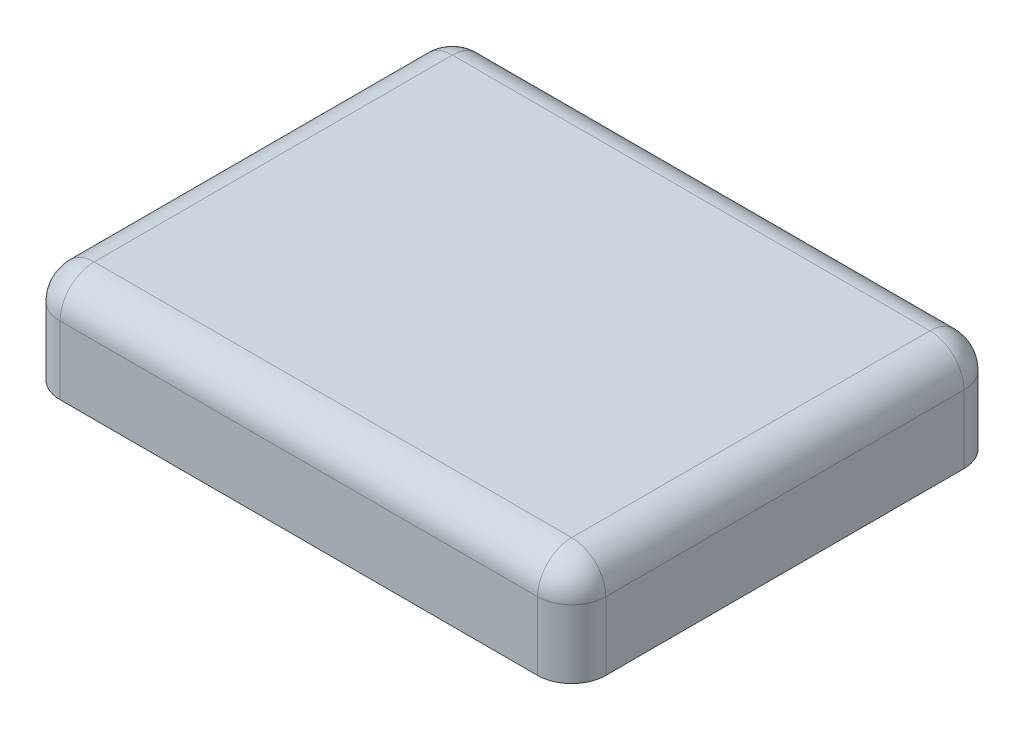
ISO-10303-21;
HEADER;
FILE_DESCRIPTION(('STEP AP214'),'2;1');
FILE_NAME('part.step','',(''),(''),'','','');
FILE_SCHEMA(('AUTOMOTIVE_DESIGN { 1 0 10303 214 1 1 1 1 }'));
ENDSEC;
DATA;
#1=APPLICATION_CONTEXT('core data for automotive mechanical design processes');
#2=APPLICATION_PROTOCOL_DEFINITION('international standard','automotive_design',2000,#1);
#3=PRODUCT_CONTEXT('',#1,'mechanical');
#4=PRODUCT('Part','Part','',(#3));
#5=PRODUCT_RELATED_PRODUCT_CATEGORY('part','',(#4));
#6=PRODUCT_DEFINITION_FORMATION('','',#4);
#7=PRODUCT_DEFINITION_CONTEXT('part definition',#1,'design');
#8=PRODUCT_DEFINITION('design','',#6,#7);
#9=PRODUCT_DEFINITION_SHAPE('','',#8);
#10=(LENGTH_UNIT() NAMED_UNIT(*) SI_UNIT(.MILLI.,.METRE.));
#11=(NAMED_UNIT(*) PLANE_ANGLE_UNIT() SI_UNIT($,.RADIAN.));
#12=(NAMED_UNIT(*) SI_UNIT($,.STERADIAN.) SOLID_ANGLE_UNIT());
#13=UNCERTAINTY_MEASURE_WITH_UNIT(LENGTH_MEASURE(1.E-05),#10,'distance_accuracy_value','');
#14=(GEOMETRIC_REPRESENTATION_CONTEXT(3) GLOBAL_UNCERTAINTY_ASSIGNED_CONTEXT((#13)) GLOBAL_UNIT_ASSIGNED_CONTEXT((#10,
#11,#12)) REPRESENTATION_CONTEXT('',''));
#15=CARTESIAN_POINT('',(0.,0.,0.));
#16=DIRECTION('',(0.,0.,1.));
#17=DIRECTION('',(1.,0.,0.));
#18=AXIS2_PLACEMENT_3D('',#15,#16,#17);
#19=CARTESIAN_POINT('',(1.6,0.6,-1.25));
#20=DIRECTION('',(-1.,0.,0.));
#21=DIRECTION('',(0.,0.,1.));
#22=AXIS2_PLACEMENT_3D('',#19,#20,#21);
#23=PLANE('',#22);
#24=DIRECTION('',(0.,-1.,0.));
#25=VECTOR('',#24,1.);
#26=CARTESIAN_POINT('',(1.6,0.6,-1.05));
#27=LINE('',#26,#25);
#28=CARTESIAN_POINT('',(1.6,0.,-1.05));
#29=VERTEX_POINT('',#28);
#30=CARTESIAN_POINT('',(1.6,0.4,-1.05));
#31=VERTEX_POINT('',#30);
#32=EDGE_CURVE('E122',#29,#31,#27,.F.);
#33=ORIENTED_EDGE('',*,*,#32,.T.);
#34=DIRECTION('',(0.,0.,-1.));
#35=VECTOR('',#34,1.);
#36=CARTESIAN_POINT('',(1.6,0.4,1.05));
#37=LINE('',#36,#35);
#38=CARTESIAN_POINT('',(1.6,0.4,1.05));
#39=VERTEX_POINT('',#38);
#40=EDGE_CURVE('E62',#31,#39,#37,.F.);
#41=ORIENTED_EDGE('',*,*,#40,.T.);
#42=DIRECTION('',(0.,-1.,0.));
#43=VECTOR('',#42,1.);
#44=CARTESIAN_POINT('',(1.6,0.6,1.05));
#45=LINE('',#44,#43);
#46=CARTESIAN_POINT('',(1.6,0.,1.05));
#47=VERTEX_POINT('',#46);
#48=EDGE_CURVE('E115',#39,#47,#45,.T.);
#49=ORIENTED_EDGE('',*,*,#48,.T.);
#50=DIRECTION('',(0.,0.,-1.));
#51=VECTOR('',#50,1.);
#52=CARTESIAN_POINT('',(1.6,0.,-1.25));
#53=LINE('',#52,#51);
#54=EDGE_CURVE('E118',#47,#29,#53,.T.);
#55=ORIENTED_EDGE('',*,*,#54,.T.);
#56=EDGE_LOOP('',(#33,#41,#49,#55));
#57=FACE_BOUND('',#56,.T.);
#58=ADVANCED_FACE('F38',(#57),#23,.F.);
#59=CARTESIAN_POINT('',(-1.6,0.6,-1.25));
#60=DIRECTION('',(0.,0.,1.));
#61=DIRECTION('',(1.,0.,0.));
#62=AXIS2_PLACEMENT_3D('',#59,#60,#61);
#63=PLANE('',#62);
#64=DIRECTION('',(0.,-1.,0.));
#65=VECTOR('',#64,1.);
#66=CARTESIAN_POINT('',(-1.4,0.6,-1.25));
#67=LINE('',#66,#65);
#68=CARTESIAN_POINT('',(-1.4,0.,-1.25));
#69=VERTEX_POINT('',#68);
#70=CARTESIAN_POINT('',(-1.4,0.4,-1.25));
#71=VERTEX_POINT('',#70);
#72=EDGE_CURVE('E155',#69,#71,#67,.F.);
#73=ORIENTED_EDGE('',*,*,#72,.T.);
#74=DIRECTION('',(-1.,0.,0.));
#75=VECTOR('',#74,1.);
#76=CARTESIAN_POINT('',(1.4,0.4,-1.25));
#77=LINE('',#76,#75);
#78=CARTESIAN_POINT('',(1.4,0.4,-1.25));
#79=VERTEX_POINT('',#78);
#80=EDGE_CURVE('E181',#71,#79,#77,.F.);
#81=ORIENTED_EDGE('',*,*,#80,.T.);
#82=DIRECTION('',(0.,-1.,0.));
#83=VECTOR('',#82,1.);
#84=CARTESIAN_POINT('',(1.4,0.6,-1.25));
#85=LINE('',#84,#83);
#86=CARTESIAN_POINT('',(1.4,0.,-1.25));
#87=VERTEX_POINT('',#86);
#88=EDGE_CURVE('E158',#79,#87,#85,.T.);
#89=ORIENTED_EDGE('',*,*,#88,.T.);
#90=DIRECTION('',(-1.,0.,0.));
#91=VECTOR('',#90,1.);
#92=CARTESIAN_POINT('',(-1.6,0.,-1.25));
#93=LINE('',#92,#91);
#94=EDGE_CURVE('E136',#87,#69,#93,.T.);
#95=ORIENTED_EDGE('',*,*,#94,.T.);
#96=EDGE_LOOP('',(#73,#81,#89,#95));
#97=FACE_BOUND('',#96,.T.);
#98=ADVANCED_FACE('F240',(#97),#63,.F.);
#99=CARTESIAN_POINT('',(-1.6,0.6,-1.25));
#100=DIRECTION('',(1.,0.,0.));
#101=DIRECTION('',(0.,0.,-1.));
#102=AXIS2_PLACEMENT_3D('',#99,#100,#101);
#103=PLANE('',#102);
#104=DIRECTION('',(0.,-1.,0.));
#105=VECTOR('',#104,1.);
#106=CARTESIAN_POINT('',(-1.6,0.6,1.05));
#107=LINE('',#106,#105);
#108=CARTESIAN_POINT('',(-1.6,0.,1.05));
#109=VERTEX_POINT('',#108);
#110=CARTESIAN_POINT('',(-1.6,0.4,1.05));
#111=VERTEX_POINT('',#110);
#112=EDGE_CURVE('E162',#109,#111,#107,.F.);
#113=ORIENTED_EDGE('',*,*,#112,.T.);
#114=DIRECTION('',(0.,0.,1.));
#115=VECTOR('',#114,1.);
#116=CARTESIAN_POINT('',(-1.6,0.4,-1.05));
#117=LINE('',#116,#115);
#118=CARTESIAN_POINT('',(-1.6,0.4,-1.05));
#119=VERTEX_POINT('',#118);
#120=EDGE_CURVE('E177',#111,#119,#117,.F.);
#121=ORIENTED_EDGE('',*,*,#120,.T.);
#122=DIRECTION('',(0.,-1.,0.));
#123=VECTOR('',#122,1.);
#124=CARTESIAN_POINT('',(-1.6,0.6,-1.05));
#125=LINE('',#124,#123);
#126=CARTESIAN_POINT('',(-1.6,0.,-1.05));
#127=VERTEX_POINT('',#126);
#128=EDGE_CURVE('E160',#119,#127,#125,.T.);
#129=ORIENTED_EDGE('',*,*,#128,.T.);
#130=DIRECTION('',(0.,0.,1.));
#131=VECTOR('',#130,1.);
#132=CARTESIAN_POINT('',(-1.6,0.,-1.25));
#133=LINE('',#132,#131);
#134=EDGE_CURVE('E139',#127,#109,#133,.T.);
#135=ORIENTED_EDGE('',*,*,#134,.T.);
#136=EDGE_LOOP('',(#113,#121,#129,#135));
#137=FACE_BOUND('',#136,.T.);
#138=ADVANCED_FACE('F245',(#137),#103,.F.);
#139=CARTESIAN_POINT('',(-1.6,0.6,1.25));
#140=DIRECTION('',(0.,0.,-1.));
#141=DIRECTION('',(-1.,0.,0.));
#142=AXIS2_PLACEMENT_3D('',#139,#140,#141);
#143=PLANE('',#142);
#144=DIRECTION('',(0.,-1.,0.));
#145=VECTOR('',#144,1.);
#146=CARTESIAN_POINT('',(1.4,0.6,1.25));
#147=LINE('',#146,#145);
#148=CARTESIAN_POINT('',(1.4,0.,1.25));
#149=VERTEX_POINT('',#148);
#150=CARTESIAN_POINT('',(1.4,0.4,1.25));
#151=VERTEX_POINT('',#150);
#152=EDGE_CURVE('E126',#149,#151,#147,.F.);
#153=ORIENTED_EDGE('',*,*,#152,.T.);
#154=DIRECTION('',(1.,0.,0.));
#155=VECTOR('',#154,1.);
#156=CARTESIAN_POINT('',(-1.4,0.4,1.25));
#157=LINE('',#156,#155);
#158=CARTESIAN_POINT('',(-1.4,0.4,1.25));
#159=VERTEX_POINT('',#158);
#160=EDGE_CURVE('E11',#151,#159,#157,.F.);
#161=ORIENTED_EDGE('',*,*,#160,.T.);
#162=DIRECTION('',(0.,-1.,0.));
#163=VECTOR('',#162,1.);
#164=CARTESIAN_POINT('',(-1.4,0.6,1.25));
#165=LINE('',#164,#163);
#166=CARTESIAN_POINT('',(-1.4,0.,1.25));
#167=VERTEX_POINT('',#166);
#168=EDGE_CURVE('E130',#159,#167,#165,.T.);
#169=ORIENTED_EDGE('',*,*,#168,.T.);
#170=DIRECTION('',(1.,0.,0.));
#171=VECTOR('',#170,1.);
#172=CARTESIAN_POINT('',(-1.6,0.,1.25));
#173=LINE('',#172,#171);
#174=EDGE_CURVE('E146',#167,#149,#173,.T.);
#175=ORIENTED_EDGE('',*,*,#174,.T.);
#176=EDGE_LOOP('',(#153,#161,#169,#175));
#177=FACE_BOUND('',#176,.T.);
#178=ADVANCED_FACE('F358',(#177),#143,.F.);
#179=CARTESIAN_POINT('',(0.,0.6,0.));
#180=DIRECTION('',(0.,1.,0.));
#181=DIRECTION('',(0.,0.,1.));
#182=AXIS2_PLACEMENT_3D('',#179,#180,#181);
#183=PLANE('',#182);
#184=DIRECTION('',(-1.,0.,0.));
#185=VECTOR('',#184,1.);
#186=CARTESIAN_POINT('',(-1.4,0.6,-1.05));
#187=LINE('',#186,#185);
#188=CARTESIAN_POINT('',(1.4,0.6,-1.05));
#189=VERTEX_POINT('',#188);
#190=CARTESIAN_POINT('',(-1.4,0.6,-1.05));
#191=VERTEX_POINT('',#190);
#192=EDGE_CURVE('E172',#189,#191,#187,.T.);
#193=ORIENTED_EDGE('',*,*,#192,.T.);
#194=DIRECTION('',(0.,0.,1.));
#195=VECTOR('',#194,1.);
#196=CARTESIAN_POINT('',(-1.4,0.6,1.05));
#197=LINE('',#196,#195);
#198=CARTESIAN_POINT('',(-1.4,0.6,1.05));
#199=VERTEX_POINT('',#198);
#200=EDGE_CURVE('E174',#191,#199,#197,.T.);
#201=ORIENTED_EDGE('',*,*,#200,.T.);
#202=DIRECTION('',(1.,0.,0.));
#203=VECTOR('',#202,1.);
#204=CARTESIAN_POINT('',(1.4,0.6,1.05));
#205=LINE('',#204,#203);
#206=CARTESIAN_POINT('',(1.4,0.6,1.05));
#207=VERTEX_POINT('',#206);
#208=EDGE_CURVE('E168',#199,#207,#205,.T.);
#209=ORIENTED_EDGE('',*,*,#208,.T.);
#210=DIRECTION('',(0.,0.,-1.));
#211=VECTOR('',#210,1.);
#212=CARTESIAN_POINT('',(1.4,0.6,-1.05));
#213=LINE('',#212,#211);
#214=EDGE_CURVE('E170',#207,#189,#213,.T.);
#215=ORIENTED_EDGE('',*,*,#214,.T.);
#216=EDGE_LOOP('',(#193,#201,#209,#215));
#217=FACE_BOUND('',#216,.T.);
#218=ADVANCED_FACE('F217',(#217),#183,.T.);
#219=CARTESIAN_POINT('',(0.,0.,0.));
#220=DIRECTION('',(0.,1.,0.));
#221=DIRECTION('',(0.,0.,1.));
#222=AXIS2_PLACEMENT_3D('',#219,#220,#221);
#223=PLANE('',#222);
#224=ORIENTED_EDGE('',*,*,#54,.F.);
#225=CARTESIAN_POINT('',(1.4,0.,1.05));
#226=DIRECTION('',(0.,1.,0.));
#227=DIRECTION('',(0.,0.,1.));
#228=AXIS2_PLACEMENT_3D('',#225,#226,#227);
#229=CIRCLE('',#228,0.2);
#230=EDGE_CURVE('E124',#47,#149,#229,.F.);
#231=ORIENTED_EDGE('',*,*,#230,.T.);
#232=ORIENTED_EDGE('',*,*,#174,.F.);
#233=CARTESIAN_POINT('',(-1.4,0.,1.05));
#234=DIRECTION('',(0.,1.,0.));
#235=DIRECTION('',(0.,0.,1.));
#236=AXIS2_PLACEMENT_3D('',#233,#234,#235);
#237=CIRCLE('',#236,0.2);
#238=EDGE_CURVE('E150',#167,#109,#237,.F.);
#239=ORIENTED_EDGE('',*,*,#238,.T.);
#240=ORIENTED_EDGE('',*,*,#134,.F.);
#241=CARTESIAN_POINT('',(-1.4,0.,-1.05));
#242=DIRECTION('',(0.,1.,0.));
#243=DIRECTION('',(0.,0.,1.));
#244=AXIS2_PLACEMENT_3D('',#241,#242,#243);
#245=CIRCLE('',#244,0.2);
#246=EDGE_CURVE('E121',#127,#69,#245,.F.);
#247=ORIENTED_EDGE('',*,*,#246,.T.);
#248=ORIENTED_EDGE('',*,*,#94,.F.);
#249=CARTESIAN_POINT('',(1.4,0.,-1.05));
#250=DIRECTION('',(0.,1.,0.));
#251=DIRECTION('',(0.,0.,1.));
#252=AXIS2_PLACEMENT_3D('',#249,#250,#251);
#253=CIRCLE('',#252,0.2);
#254=EDGE_CURVE('E131',#87,#29,#253,.F.);
#255=ORIENTED_EDGE('',*,*,#254,.T.);
#256=EDGE_LOOP('',(#224,#231,#232,#239,#240,#247,#248,#255));
#257=FACE_BOUND('',#256,.T.);
#258=ADVANCED_FACE('F133',(#257),#223,.F.);
#259=CARTESIAN_POINT('',(1.4,0.6,1.05));
#260=DIRECTION('',(0.,-1.,0.));
#261=DIRECTION('',(0.,0.,-1.));
#262=AXIS2_PLACEMENT_3D('',#259,#260,#261);
#263=CYLINDRICAL_SURFACE('',#262,0.2);
#264=ORIENTED_EDGE('',*,*,#48,.F.);
#265=CARTESIAN_POINT('',(1.4,0.4,1.05));
#266=DIRECTION('',(0.,-1.,0.));
#267=DIRECTION('',(0.,0.,-1.));
#268=AXIS2_PLACEMENT_3D('',#265,#266,#267);
#269=CIRCLE('',#268,0.2);
#270=EDGE_CURVE('E47',#39,#151,#269,.T.);
#271=ORIENTED_EDGE('',*,*,#270,.T.);
#272=ORIENTED_EDGE('',*,*,#152,.F.);
#273=ORIENTED_EDGE('',*,*,#230,.F.);
#274=EDGE_LOOP('',(#264,#271,#272,#273));
#275=FACE_BOUND('',#274,.T.);
#276=ADVANCED_FACE('F125',(#275),#263,.T.);
#277=CARTESIAN_POINT('',(1.4,0.6,-1.05));
#278=DIRECTION('',(0.,-1.,0.));
#279=DIRECTION('',(0.,0.,-1.));
#280=AXIS2_PLACEMENT_3D('',#277,#278,#279);
#281=CYLINDRICAL_SURFACE('',#280,0.2);
#282=ORIENTED_EDGE('',*,*,#88,.F.);
#283=CARTESIAN_POINT('',(1.4,0.4,-1.05));
#284=DIRECTION('',(0.,-1.,0.));
#285=DIRECTION('',(0.,0.,-1.));
#286=AXIS2_PLACEMENT_3D('',#283,#284,#285);
#287=CIRCLE('',#286,0.2);
#288=EDGE_CURVE('E183',#79,#31,#287,.T.);
#289=ORIENTED_EDGE('',*,*,#288,.T.);
#290=ORIENTED_EDGE('',*,*,#32,.F.);
#291=ORIENTED_EDGE('',*,*,#254,.F.);
#292=EDGE_LOOP('',(#282,#289,#290,#291));
#293=FACE_BOUND('',#292,.T.);
#294=ADVANCED_FACE('F252',(#293),#281,.T.);
#295=CARTESIAN_POINT('',(-1.4,0.6,1.05));
#296=DIRECTION('',(0.,-1.,0.));
#297=DIRECTION('',(0.,0.,-1.));
#298=AXIS2_PLACEMENT_3D('',#295,#296,#297);
#299=CYLINDRICAL_SURFACE('',#298,0.2);
#300=ORIENTED_EDGE('',*,*,#168,.F.);
#301=CARTESIAN_POINT('',(-1.4,0.4,1.05));
#302=DIRECTION('',(0.,-1.,0.));
#303=DIRECTION('',(0.,0.,-1.));
#304=AXIS2_PLACEMENT_3D('',#301,#302,#303);
#305=CIRCLE('',#304,0.2);
#306=EDGE_CURVE('E165',#159,#111,#305,.T.);
#307=ORIENTED_EDGE('',*,*,#306,.T.);
#308=ORIENTED_EDGE('',*,*,#112,.F.);
#309=ORIENTED_EDGE('',*,*,#238,.F.);
#310=EDGE_LOOP('',(#300,#307,#308,#309));
#311=FACE_BOUND('',#310,.T.);
#312=ADVANCED_FACE('F255',(#311),#299,.T.);
#313=CARTESIAN_POINT('',(-1.4,0.6,-1.05));
#314=DIRECTION('',(0.,-1.,0.));
#315=DIRECTION('',(0.,0.,-1.));
#316=AXIS2_PLACEMENT_3D('',#313,#314,#315);
#317=CYLINDRICAL_SURFACE('',#316,0.2);
#318=ORIENTED_EDGE('',*,*,#128,.F.);
#319=CARTESIAN_POINT('',(-1.4,0.4,-1.05));
#320=DIRECTION('',(0.,-1.,0.));
#321=DIRECTION('',(0.,0.,-1.));
#322=AXIS2_PLACEMENT_3D('',#319,#320,#321);
#323=CIRCLE('',#322,0.2);
#324=EDGE_CURVE('E179',#119,#71,#323,.T.);
#325=ORIENTED_EDGE('',*,*,#324,.T.);
#326=ORIENTED_EDGE('',*,*,#72,.F.);
#327=ORIENTED_EDGE('',*,*,#246,.F.);
#328=EDGE_LOOP('',(#318,#325,#326,#327));
#329=FACE_BOUND('',#328,.T.);
#330=ADVANCED_FACE('F259',(#329),#317,.T.);
#331=CARTESIAN_POINT('',(1.4,0.4,-1.05));
#332=DIRECTION('',(0.,1.,0.));
#333=DIRECTION('',(0.,0.,1.));
#334=AXIS2_PLACEMENT_3D('',#331,#332,#333);
#335=SPHERICAL_SURFACE('',#334,0.2);
#336=CARTESIAN_POINT('',(1.4,0.4,-1.05));
#337=DIRECTION('',(0.,0.,1.));
#338=DIRECTION('',(1.,0.,0.));
#339=AXIS2_PLACEMENT_3D('',#336,#337,#338);
#340=CIRCLE('',#339,0.2);
#341=EDGE_CURVE('E142',#31,#189,#340,.T.);
#342=ORIENTED_EDGE('',*,*,#341,.F.);
#343=ORIENTED_EDGE('',*,*,#288,.F.);
#344=CARTESIAN_POINT('',(1.4,0.4,-1.05));
#345=DIRECTION('',(-1.,0.,0.));
#346=DIRECTION('',(0.,0.,1.));
#347=AXIS2_PLACEMENT_3D('',#344,#345,#346);
#348=CIRCLE('',#347,0.2);
#349=EDGE_CURVE('E42',#189,#79,#348,.T.);
#350=ORIENTED_EDGE('',*,*,#349,.F.);
#351=EDGE_LOOP('',(#342,#343,#350));
#352=FACE_BOUND('',#351,.T.);
#353=ADVANCED_FACE('F40',(#352),#335,.T.);
#354=CARTESIAN_POINT('',(0.,0.4,-1.05));
#355=DIRECTION('',(1.,0.,0.));
#356=DIRECTION('',(0.,0.,-1.));
#357=AXIS2_PLACEMENT_3D('',#354,#355,#356);
#358=CYLINDRICAL_SURFACE('',#357,0.2);
#359=ORIENTED_EDGE('',*,*,#349,.T.);
#360=ORIENTED_EDGE('',*,*,#80,.F.);
#361=CARTESIAN_POINT('',(-1.4,0.4,-1.05));
#362=DIRECTION('',(-1.,0.,0.));
#363=DIRECTION('',(0.,0.,1.));
#364=AXIS2_PLACEMENT_3D('',#361,#362,#363);
#365=CIRCLE('',#364,0.2);
#366=EDGE_CURVE('E200',#191,#71,#365,.T.);
#367=ORIENTED_EDGE('',*,*,#366,.F.);
#368=ORIENTED_EDGE('',*,*,#192,.F.);
#369=EDGE_LOOP('',(#359,#360,#367,#368));
#370=FACE_BOUND('',#369,.T.);
#371=ADVANCED_FACE('F214',(#370),#358,.T.);
#372=CARTESIAN_POINT('',(1.4,0.4,0.));
#373=DIRECTION('',(0.,0.,1.));
#374=DIRECTION('',(1.,0.,0.));
#375=AXIS2_PLACEMENT_3D('',#372,#373,#374);
#376=CYLINDRICAL_SURFACE('',#375,0.2);
#377=ORIENTED_EDGE('',*,*,#341,.T.);
#378=ORIENTED_EDGE('',*,*,#214,.F.);
#379=CARTESIAN_POINT('',(1.4,0.4,1.05));
#380=DIRECTION('',(0.,0.,1.));
#381=DIRECTION('',(1.,0.,0.));
#382=AXIS2_PLACEMENT_3D('',#379,#380,#381);
#383=CIRCLE('',#382,0.2);
#384=EDGE_CURVE('E197',#39,#207,#383,.T.);
#385=ORIENTED_EDGE('',*,*,#384,.F.);
#386=ORIENTED_EDGE('',*,*,#40,.F.);
#387=EDGE_LOOP('',(#377,#378,#385,#386));
#388=FACE_BOUND('',#387,.T.);
#389=ADVANCED_FACE('F207',(#388),#376,.T.);
#390=CARTESIAN_POINT('',(-1.4,0.4,-1.05));
#391=DIRECTION('',(0.,1.,0.));
#392=DIRECTION('',(0.,0.,1.));
#393=AXIS2_PLACEMENT_3D('',#390,#391,#392);
#394=SPHERICAL_SURFACE('',#393,0.2);
#395=ORIENTED_EDGE('',*,*,#366,.T.);
#396=ORIENTED_EDGE('',*,*,#324,.F.);
#397=CARTESIAN_POINT('',(-1.4,0.4,-1.05));
#398=DIRECTION('',(0.,0.,1.));
#399=DIRECTION('',(1.,0.,0.));
#400=AXIS2_PLACEMENT_3D('',#397,#398,#399);
#401=CIRCLE('',#400,0.2);
#402=EDGE_CURVE('E194',#191,#119,#401,.T.);
#403=ORIENTED_EDGE('',*,*,#402,.F.);
#404=EDGE_LOOP('',(#395,#396,#403));
#405=FACE_BOUND('',#404,.T.);
#406=ADVANCED_FACE('F229',(#405),#394,.T.);
#407=CARTESIAN_POINT('',(1.4,0.4,1.05));
#408=DIRECTION('',(0.,1.,0.));
#409=DIRECTION('',(0.,0.,1.));
#410=AXIS2_PLACEMENT_3D('',#407,#408,#409);
#411=SPHERICAL_SURFACE('',#410,0.2);
#412=ORIENTED_EDGE('',*,*,#270,.F.);
#413=ORIENTED_EDGE('',*,*,#384,.T.);
#414=CARTESIAN_POINT('',(1.4,0.4,1.05));
#415=DIRECTION('',(-1.,0.,0.));
#416=DIRECTION('',(0.,0.,1.));
#417=AXIS2_PLACEMENT_3D('',#414,#415,#416);
#418=CIRCLE('',#417,0.2);
#419=EDGE_CURVE('E191',#151,#207,#418,.T.);
#420=ORIENTED_EDGE('',*,*,#419,.F.);
#421=EDGE_LOOP('',(#412,#413,#420));
#422=FACE_BOUND('',#421,.T.);
#423=ADVANCED_FACE('F226',(#422),#411,.T.);
#424=CARTESIAN_POINT('',(-1.4,0.4,0.));
#425=DIRECTION('',(0.,0.,-1.));
#426=DIRECTION('',(-1.,0.,0.));
#427=AXIS2_PLACEMENT_3D('',#424,#425,#426);
#428=CYLINDRICAL_SURFACE('',#427,0.2);
#429=ORIENTED_EDGE('',*,*,#402,.T.);
#430=ORIENTED_EDGE('',*,*,#120,.F.);
#431=CARTESIAN_POINT('',(-1.4,0.4,1.05));
#432=DIRECTION('',(0.,0.,1.));
#433=DIRECTION('',(1.,0.,0.));
#434=AXIS2_PLACEMENT_3D('',#431,#432,#433);
#435=CIRCLE('',#434,0.2);
#436=EDGE_CURVE('E189',#199,#111,#435,.T.);
#437=ORIENTED_EDGE('',*,*,#436,.F.);
#438=ORIENTED_EDGE('',*,*,#200,.F.);
#439=EDGE_LOOP('',(#429,#430,#437,#438));
#440=FACE_BOUND('',#439,.T.);
#441=ADVANCED_FACE('F228',(#440),#428,.T.);
#442=CARTESIAN_POINT('',(0.,0.4,1.05));
#443=DIRECTION('',(-1.,0.,0.));
#444=DIRECTION('',(0.,0.,1.));
#445=AXIS2_PLACEMENT_3D('',#442,#443,#444);
#446=CYLINDRICAL_SURFACE('',#445,0.2);
#447=ORIENTED_EDGE('',*,*,#419,.T.);
#448=ORIENTED_EDGE('',*,*,#208,.F.);
#449=CARTESIAN_POINT('',(-1.4,0.4,1.05));
#450=DIRECTION('',(-1.,0.,0.));
#451=DIRECTION('',(0.,0.,1.));
#452=AXIS2_PLACEMENT_3D('',#449,#450,#451);
#453=CIRCLE('',#452,0.2);
#454=EDGE_CURVE('E187',#159,#199,#453,.T.);
#455=ORIENTED_EDGE('',*,*,#454,.F.);
#456=ORIENTED_EDGE('',*,*,#160,.F.);
#457=EDGE_LOOP('',(#447,#448,#455,#456));
#458=FACE_BOUND('',#457,.T.);
#459=ADVANCED_FACE('F222',(#458),#446,.T.);
#460=CARTESIAN_POINT('',(-1.4,0.4,1.05));
#461=DIRECTION('',(0.,1.,0.));
#462=DIRECTION('',(0.,0.,1.));
#463=AXIS2_PLACEMENT_3D('',#460,#461,#462);
#464=SPHERICAL_SURFACE('',#463,0.2);
#465=ORIENTED_EDGE('',*,*,#436,.T.);
#466=ORIENTED_EDGE('',*,*,#306,.F.);
#467=ORIENTED_EDGE('',*,*,#454,.T.);
#468=EDGE_LOOP('',(#465,#466,#467));
#469=FACE_BOUND('',#468,.T.);
#470=ADVANCED_FACE('F264',(#469),#464,.T.);
#471=CLOSED_SHELL('',(#58,#98,#138,#178,#218,#258,#276,#294,#312,#330,#353,#371,#389,#406,#423,
#441,#459,#470));
#472=MANIFOLD_SOLID_BREP('B2',#471);
#473=ADVANCED_BREP_SHAPE_REPRESENTATION('',(#18,#472),#14);
#474=SHAPE_DEFINITION_REPRESENTATION(#9,#473);
ENDSEC;
END-ISO-10303-21;
